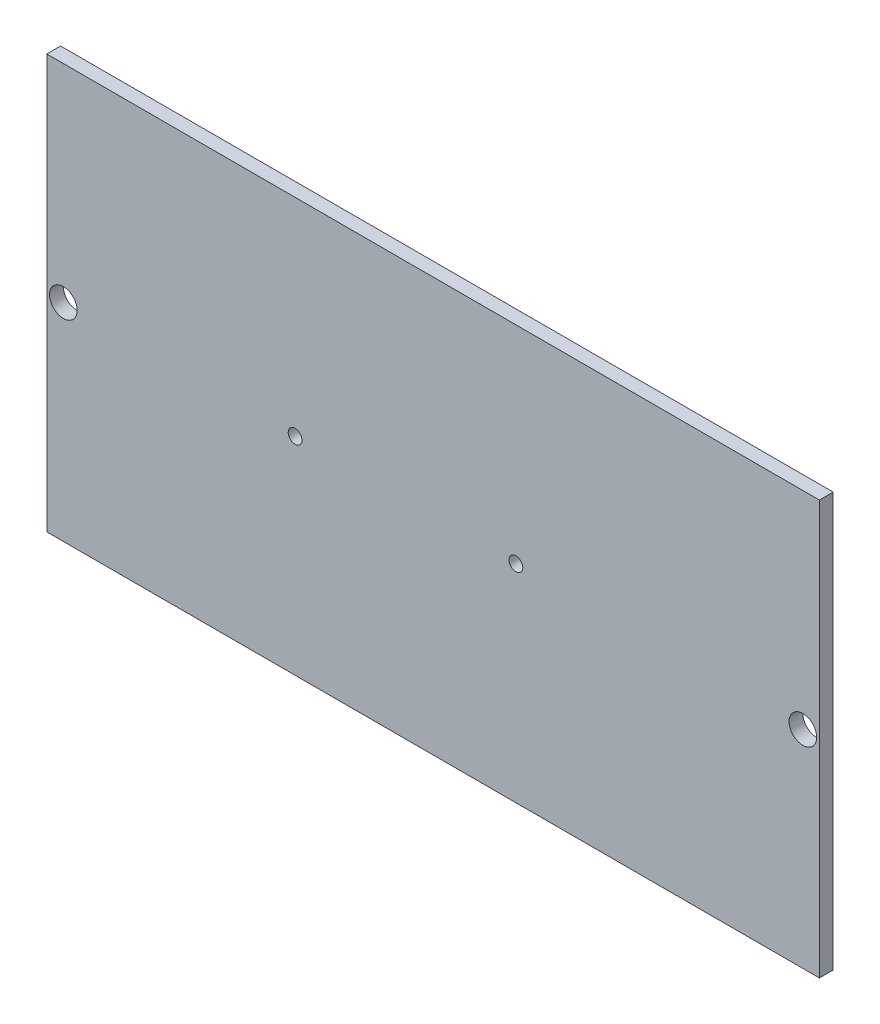
ISO-10303-21;
HEADER;
FILE_DESCRIPTION(('STEP AP214'),'2;1');
FILE_NAME('part.step','',(''),(''),'','','');
FILE_SCHEMA(('AUTOMOTIVE_DESIGN { 1 0 10303 214 1 1 1 1 }'));
ENDSEC;
DATA;
#1=APPLICATION_CONTEXT('core data for automotive mechanical design processes');
#2=APPLICATION_PROTOCOL_DEFINITION('international standard','automotive_design',2000,#1);
#3=PRODUCT_CONTEXT('',#1,'mechanical');
#4=PRODUCT('Part','Part','',(#3));
#5=PRODUCT_RELATED_PRODUCT_CATEGORY('part','',(#4));
#6=PRODUCT_DEFINITION_FORMATION('','',#4);
#7=PRODUCT_DEFINITION_CONTEXT('part definition',#1,'design');
#8=PRODUCT_DEFINITION('design','',#6,#7);
#9=PRODUCT_DEFINITION_SHAPE('','',#8);
#10=(LENGTH_UNIT() NAMED_UNIT(*) SI_UNIT(.MILLI.,.METRE.));
#11=(NAMED_UNIT(*) PLANE_ANGLE_UNIT() SI_UNIT($,.RADIAN.));
#12=(NAMED_UNIT(*) SI_UNIT($,.STERADIAN.) SOLID_ANGLE_UNIT());
#13=UNCERTAINTY_MEASURE_WITH_UNIT(LENGTH_MEASURE(1.E-05),#10,'distance_accuracy_value','');
#14=(GEOMETRIC_REPRESENTATION_CONTEXT(3) GLOBAL_UNCERTAINTY_ASSIGNED_CONTEXT((#13)) GLOBAL_UNIT_ASSIGNED_CONTEXT((#10,
#11,#12)) REPRESENTATION_CONTEXT('',''));
#15=CARTESIAN_POINT('',(0.,0.,0.));
#16=DIRECTION('',(0.,0.,1.));
#17=DIRECTION('',(1.,0.,0.));
#18=AXIS2_PLACEMENT_3D('',#15,#16,#17);
#19=CARTESIAN_POINT('',(0.,0.,5.));
#20=DIRECTION('',(0.,0.,1.));
#21=DIRECTION('',(1.,0.,0.));
#22=AXIS2_PLACEMENT_3D('',#19,#20,#21);
#23=PLANE('',#22);
#24=DIRECTION('',(0.,-1.,0.));
#25=VECTOR('',#24,1.);
#26=CARTESIAN_POINT('',(0.,150.,5.));
#27=LINE('',#26,#25);
#28=CARTESIAN_POINT('',(0.,150.,5.));
#29=VERTEX_POINT('',#28);
#30=CARTESIAN_POINT('',(0.,0.,5.));
#31=VERTEX_POINT('',#30);
#32=EDGE_CURVE('E85',#29,#31,#27,.T.);
#33=ORIENTED_EDGE('',*,*,#32,.T.);
#34=DIRECTION('',(1.,0.,0.));
#35=VECTOR('',#34,1.);
#36=CARTESIAN_POINT('',(0.,0.,5.));
#37=LINE('',#36,#35);
#38=CARTESIAN_POINT('',(280.,0.,5.));
#39=VERTEX_POINT('',#38);
#40=EDGE_CURVE('E80',#31,#39,#37,.T.);
#41=ORIENTED_EDGE('',*,*,#40,.T.);
#42=DIRECTION('',(0.,1.,0.));
#43=VECTOR('',#42,1.);
#44=CARTESIAN_POINT('',(280.,150.,5.));
#45=LINE('',#44,#43);
#46=CARTESIAN_POINT('',(280.,150.,5.));
#47=VERTEX_POINT('',#46);
#48=EDGE_CURVE('E83',#39,#47,#45,.T.);
#49=ORIENTED_EDGE('',*,*,#48,.T.);
#50=DIRECTION('',(-1.,0.,0.));
#51=VECTOR('',#50,1.);
#52=CARTESIAN_POINT('',(0.,150.,5.));
#53=LINE('',#52,#51);
#54=EDGE_CURVE('E50',#47,#29,#53,.T.);
#55=ORIENTED_EDGE('',*,*,#54,.T.);
#56=EDGE_LOOP('',(#33,#41,#49,#55));
#57=FACE_BOUND('',#56,.T.);
#58=CARTESIAN_POINT('',(90.,75.,5.));
#59=DIRECTION('',(0.,0.,1.));
#60=DIRECTION('',(1.,0.,0.));
#61=AXIS2_PLACEMENT_3D('',#58,#59,#60);
#62=CIRCLE('',#61,2.50000000000001);
#63=CARTESIAN_POINT('',(92.5,75.,5.));
#64=VERTEX_POINT('',#63);
#65=EDGE_CURVE('E112',#64,#64,#62,.T.);
#66=ORIENTED_EDGE('',*,*,#65,.F.);
#67=EDGE_LOOP('',(#66));
#68=FACE_BOUND('',#67,.T.);
#69=CARTESIAN_POINT('',(170.,75.,5.));
#70=DIRECTION('',(0.,0.,1.));
#71=DIRECTION('',(1.,0.,0.));
#72=AXIS2_PLACEMENT_3D('',#69,#70,#71);
#73=CIRCLE('',#72,2.5);
#74=CARTESIAN_POINT('',(172.5,75.,5.));
#75=VERTEX_POINT('',#74);
#76=EDGE_CURVE('E118',#75,#75,#73,.T.);
#77=ORIENTED_EDGE('',*,*,#76,.F.);
#78=EDGE_LOOP('',(#77));
#79=FACE_BOUND('',#78,.T.);
#80=CARTESIAN_POINT('',(6.,75.,5.));
#81=DIRECTION('',(0.,0.,1.));
#82=DIRECTION('',(1.,0.,0.));
#83=AXIS2_PLACEMENT_3D('',#80,#81,#82);
#84=CIRCLE('',#83,5.);
#85=CARTESIAN_POINT('',(11.,75.,5.));
#86=VERTEX_POINT('',#85);
#87=EDGE_CURVE('E124',#86,#86,#84,.T.);
#88=ORIENTED_EDGE('',*,*,#87,.F.);
#89=EDGE_LOOP('',(#88));
#90=FACE_BOUND('',#89,.T.);
#91=CARTESIAN_POINT('',(274.,75.,5.));
#92=DIRECTION('',(0.,0.,-1.));
#93=DIRECTION('',(-1.,0.,0.));
#94=AXIS2_PLACEMENT_3D('',#91,#92,#93);
#95=CIRCLE('',#94,5.);
#96=CARTESIAN_POINT('',(269.,75.,5.));
#97=VERTEX_POINT('',#96);
#98=EDGE_CURVE('E130',#97,#97,#95,.T.);
#99=ORIENTED_EDGE('',*,*,#98,.T.);
#100=EDGE_LOOP('',(#99));
#101=FACE_BOUND('',#100,.T.);
#102=ADVANCED_FACE('F33',(#57,#68,#79,#90,#101),#23,.T.);
#103=CARTESIAN_POINT('',(0.,0.,0.));
#104=DIRECTION('',(0.,0.,1.));
#105=DIRECTION('',(1.,0.,0.));
#106=AXIS2_PLACEMENT_3D('',#103,#104,#105);
#107=PLANE('',#106);
#108=DIRECTION('',(0.,-1.,0.));
#109=VECTOR('',#108,1.);
#110=CARTESIAN_POINT('',(0.,150.,0.));
#111=LINE('',#110,#109);
#112=CARTESIAN_POINT('',(0.,150.,0.));
#113=VERTEX_POINT('',#112);
#114=CARTESIAN_POINT('',(0.,0.,0.));
#115=VERTEX_POINT('',#114);
#116=EDGE_CURVE('E97',#113,#115,#111,.T.);
#117=ORIENTED_EDGE('',*,*,#116,.F.);
#118=DIRECTION('',(-1.,0.,0.));
#119=VECTOR('',#118,1.);
#120=CARTESIAN_POINT('',(0.,150.,0.));
#121=LINE('',#120,#119);
#122=CARTESIAN_POINT('',(280.,150.,0.));
#123=VERTEX_POINT('',#122);
#124=EDGE_CURVE('E73',#123,#113,#121,.T.);
#125=ORIENTED_EDGE('',*,*,#124,.F.);
#126=DIRECTION('',(0.,1.,0.));
#127=VECTOR('',#126,1.);
#128=CARTESIAN_POINT('',(280.,150.,0.));
#129=LINE('',#128,#127);
#130=CARTESIAN_POINT('',(280.,0.,0.));
#131=VERTEX_POINT('',#130);
#132=EDGE_CURVE('E67',#131,#123,#129,.T.);
#133=ORIENTED_EDGE('',*,*,#132,.F.);
#134=DIRECTION('',(1.,0.,0.));
#135=VECTOR('',#134,1.);
#136=CARTESIAN_POINT('',(0.,0.,0.));
#137=LINE('',#136,#135);
#138=EDGE_CURVE('E89',#115,#131,#137,.T.);
#139=ORIENTED_EDGE('',*,*,#138,.F.);
#140=EDGE_LOOP('',(#117,#125,#133,#139));
#141=FACE_BOUND('',#140,.T.);
#142=CARTESIAN_POINT('',(90.,75.,0.));
#143=DIRECTION('',(0.,0.,1.));
#144=DIRECTION('',(1.,0.,0.));
#145=AXIS2_PLACEMENT_3D('',#142,#143,#144);
#146=CIRCLE('',#145,2.50000000000001);
#147=CARTESIAN_POINT('',(92.5,75.,0.));
#148=VERTEX_POINT('',#147);
#149=EDGE_CURVE('E100',#148,#148,#146,.T.);
#150=ORIENTED_EDGE('',*,*,#149,.T.);
#151=EDGE_LOOP('',(#150));
#152=FACE_BOUND('',#151,.T.);
#153=CARTESIAN_POINT('',(170.,75.,0.));
#154=DIRECTION('',(0.,0.,1.));
#155=DIRECTION('',(1.,0.,0.));
#156=AXIS2_PLACEMENT_3D('',#153,#154,#155);
#157=CIRCLE('',#156,2.5);
#158=CARTESIAN_POINT('',(172.5,75.,0.));
#159=VERTEX_POINT('',#158);
#160=EDGE_CURVE('E115',#159,#159,#157,.T.);
#161=ORIENTED_EDGE('',*,*,#160,.T.);
#162=EDGE_LOOP('',(#161));
#163=FACE_BOUND('',#162,.T.);
#164=CARTESIAN_POINT('',(6.,75.,0.));
#165=DIRECTION('',(0.,0.,1.));
#166=DIRECTION('',(1.,0.,0.));
#167=AXIS2_PLACEMENT_3D('',#164,#165,#166);
#168=CIRCLE('',#167,5.);
#169=CARTESIAN_POINT('',(11.,75.,0.));
#170=VERTEX_POINT('',#169);
#171=EDGE_CURVE('E121',#170,#170,#168,.T.);
#172=ORIENTED_EDGE('',*,*,#171,.T.);
#173=EDGE_LOOP('',(#172));
#174=FACE_BOUND('',#173,.T.);
#175=CARTESIAN_POINT('',(274.,75.,0.));
#176=DIRECTION('',(0.,0.,-1.));
#177=DIRECTION('',(-1.,0.,0.));
#178=AXIS2_PLACEMENT_3D('',#175,#176,#177);
#179=CIRCLE('',#178,5.);
#180=CARTESIAN_POINT('',(269.,75.,0.));
#181=VERTEX_POINT('',#180);
#182=EDGE_CURVE('E127',#181,#181,#179,.T.);
#183=ORIENTED_EDGE('',*,*,#182,.F.);
#184=EDGE_LOOP('',(#183));
#185=FACE_BOUND('',#184,.T.);
#186=ADVANCED_FACE('F108',(#141,#152,#163,#174,#185),#107,.F.);
#187=CARTESIAN_POINT('',(0.,150.,5.));
#188=DIRECTION('',(1.,0.,0.));
#189=DIRECTION('',(0.,1.,0.));
#190=AXIS2_PLACEMENT_3D('',#187,#188,#189);
#191=PLANE('',#190);
#192=ORIENTED_EDGE('',*,*,#116,.T.);
#193=DIRECTION('',(0.,0.,-1.));
#194=VECTOR('',#193,1.);
#195=CARTESIAN_POINT('',(0.,0.,5.));
#196=LINE('',#195,#194);
#197=EDGE_CURVE('E11',#31,#115,#196,.T.);
#198=ORIENTED_EDGE('',*,*,#197,.F.);
#199=ORIENTED_EDGE('',*,*,#32,.F.);
#200=DIRECTION('',(0.,0.,-1.));
#201=VECTOR('',#200,1.);
#202=CARTESIAN_POINT('',(0.,150.,5.));
#203=LINE('',#202,#201);
#204=EDGE_CURVE('E93',#29,#113,#203,.T.);
#205=ORIENTED_EDGE('',*,*,#204,.T.);
#206=EDGE_LOOP('',(#192,#198,#199,#205));
#207=FACE_BOUND('',#206,.T.);
#208=ADVANCED_FACE('F35',(#207),#191,.F.);
#209=CARTESIAN_POINT('',(0.,0.,5.));
#210=DIRECTION('',(0.,1.,0.));
#211=DIRECTION('',(0.,0.,1.));
#212=AXIS2_PLACEMENT_3D('',#209,#210,#211);
#213=PLANE('',#212);
#214=ORIENTED_EDGE('',*,*,#138,.T.);
#215=DIRECTION('',(0.,0.,-1.));
#216=VECTOR('',#215,1.);
#217=CARTESIAN_POINT('',(280.,0.,5.));
#218=LINE('',#217,#216);
#219=EDGE_CURVE('E42',#39,#131,#218,.T.);
#220=ORIENTED_EDGE('',*,*,#219,.F.);
#221=ORIENTED_EDGE('',*,*,#40,.F.);
#222=ORIENTED_EDGE('',*,*,#197,.T.);
#223=EDGE_LOOP('',(#214,#220,#221,#222));
#224=FACE_BOUND('',#223,.T.);
#225=ADVANCED_FACE('F88',(#224),#213,.F.);
#226=CARTESIAN_POINT('',(280.,150.,5.));
#227=DIRECTION('',(-1.,0.,0.));
#228=DIRECTION('',(0.,0.,1.));
#229=AXIS2_PLACEMENT_3D('',#226,#227,#228);
#230=PLANE('',#229);
#231=ORIENTED_EDGE('',*,*,#132,.T.);
#232=DIRECTION('',(0.,0.,-1.));
#233=VECTOR('',#232,1.);
#234=CARTESIAN_POINT('',(280.,150.,5.));
#235=LINE('',#234,#233);
#236=EDGE_CURVE('E90',#47,#123,#235,.T.);
#237=ORIENTED_EDGE('',*,*,#236,.F.);
#238=ORIENTED_EDGE('',*,*,#48,.F.);
#239=ORIENTED_EDGE('',*,*,#219,.T.);
#240=EDGE_LOOP('',(#231,#237,#238,#239));
#241=FACE_BOUND('',#240,.T.);
#242=ADVANCED_FACE('F91',(#241),#230,.F.);
#243=CARTESIAN_POINT('',(0.,150.,5.));
#244=DIRECTION('',(0.,-1.,0.));
#245=DIRECTION('',(0.,0.,-1.));
#246=AXIS2_PLACEMENT_3D('',#243,#244,#245);
#247=PLANE('',#246);
#248=ORIENTED_EDGE('',*,*,#124,.T.);
#249=ORIENTED_EDGE('',*,*,#204,.F.);
#250=ORIENTED_EDGE('',*,*,#54,.F.);
#251=ORIENTED_EDGE('',*,*,#236,.T.);
#252=EDGE_LOOP('',(#248,#249,#250,#251));
#253=FACE_BOUND('',#252,.T.);
#254=ADVANCED_FACE('F105',(#253),#247,.F.);
#255=CARTESIAN_POINT('',(90.,75.,0.));
#256=DIRECTION('',(0.,0.,1.));
#257=DIRECTION('',(1.,0.,0.));
#258=AXIS2_PLACEMENT_3D('',#255,#256,#257);
#259=CYLINDRICAL_SURFACE('',#258,2.50000000000001);
#260=ORIENTED_EDGE('',*,*,#149,.F.);
#261=EDGE_LOOP('',(#260));
#262=FACE_BOUND('',#261,.T.);
#263=ORIENTED_EDGE('',*,*,#65,.T.);
#264=EDGE_LOOP('',(#263));
#265=FACE_BOUND('',#264,.T.);
#266=ADVANCED_FACE('F150',(#262,#265),#259,.F.);
#267=CARTESIAN_POINT('',(170.,75.,0.));
#268=DIRECTION('',(0.,0.,1.));
#269=DIRECTION('',(1.,0.,0.));
#270=AXIS2_PLACEMENT_3D('',#267,#268,#269);
#271=CYLINDRICAL_SURFACE('',#270,2.5);
#272=ORIENTED_EDGE('',*,*,#160,.F.);
#273=EDGE_LOOP('',(#272));
#274=FACE_BOUND('',#273,.T.);
#275=ORIENTED_EDGE('',*,*,#76,.T.);
#276=EDGE_LOOP('',(#275));
#277=FACE_BOUND('',#276,.T.);
#278=ADVANCED_FACE('F171',(#274,#277),#271,.F.);
#279=CARTESIAN_POINT('',(6.,75.,0.));
#280=DIRECTION('',(0.,0.,1.));
#281=DIRECTION('',(1.,0.,0.));
#282=AXIS2_PLACEMENT_3D('',#279,#280,#281);
#283=CYLINDRICAL_SURFACE('',#282,5.);
#284=ORIENTED_EDGE('',*,*,#171,.F.);
#285=EDGE_LOOP('',(#284));
#286=FACE_BOUND('',#285,.T.);
#287=ORIENTED_EDGE('',*,*,#87,.T.);
#288=EDGE_LOOP('',(#287));
#289=FACE_BOUND('',#288,.T.);
#290=ADVANCED_FACE('F178',(#286,#289),#283,.F.);
#291=CARTESIAN_POINT('',(274.,75.,0.));
#292=DIRECTION('',(0.,0.,1.));
#293=DIRECTION('',(1.,0.,0.));
#294=AXIS2_PLACEMENT_3D('',#291,#292,#293);
#295=CYLINDRICAL_SURFACE('',#294,5.);
#296=ORIENTED_EDGE('',*,*,#182,.T.);
#297=EDGE_LOOP('',(#296));
#298=FACE_BOUND('',#297,.T.);
#299=ORIENTED_EDGE('',*,*,#98,.F.);
#300=EDGE_LOOP('',(#299));
#301=FACE_BOUND('',#300,.T.);
#302=ADVANCED_FACE('F136',(#298,#301),#295,.F.);
#303=CLOSED_SHELL('',(#102,#186,#208,#225,#242,#254,#266,#278,#290,#302));
#304=MANIFOLD_SOLID_BREP('B2',#303);
#305=ADVANCED_BREP_SHAPE_REPRESENTATION('',(#18,#304),#14);
#306=SHAPE_DEFINITION_REPRESENTATION(#9,#305);
ENDSEC;
END-ISO-10303-21;
